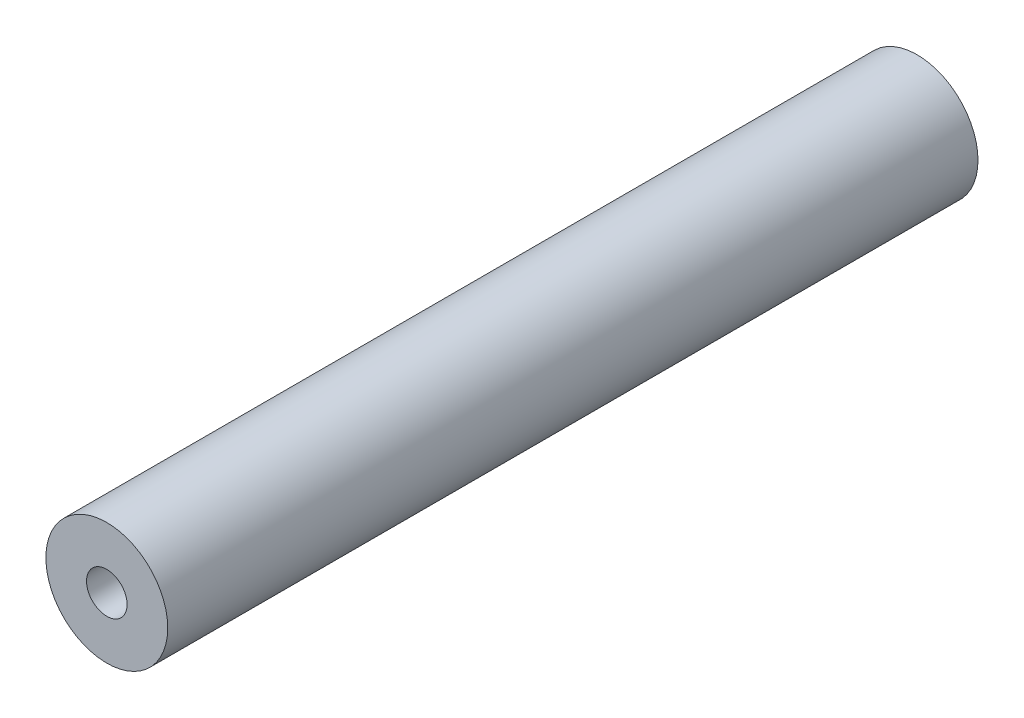
ISO-10303-21;
HEADER;
FILE_DESCRIPTION(('STEP AP214'),'2;1');
FILE_NAME('part.step','',(''),(''),'','','');
FILE_SCHEMA(('AUTOMOTIVE_DESIGN { 1 0 10303 214 1 1 1 1 }'));
ENDSEC;
DATA;
#1=APPLICATION_CONTEXT('core data for automotive mechanical design processes');
#2=APPLICATION_PROTOCOL_DEFINITION('international standard','automotive_design',2000,#1);
#3=PRODUCT_CONTEXT('',#1,'mechanical');
#4=PRODUCT('Part','Part','',(#3));
#5=PRODUCT_RELATED_PRODUCT_CATEGORY('part','',(#4));
#6=PRODUCT_DEFINITION_FORMATION('','',#4);
#7=PRODUCT_DEFINITION_CONTEXT('part definition',#1,'design');
#8=PRODUCT_DEFINITION('design','',#6,#7);
#9=PRODUCT_DEFINITION_SHAPE('','',#8);
#10=(LENGTH_UNIT() NAMED_UNIT(*) SI_UNIT(.MILLI.,.METRE.));
#11=(NAMED_UNIT(*) PLANE_ANGLE_UNIT() SI_UNIT($,.RADIAN.));
#12=(NAMED_UNIT(*) SI_UNIT($,.STERADIAN.) SOLID_ANGLE_UNIT());
#13=UNCERTAINTY_MEASURE_WITH_UNIT(LENGTH_MEASURE(1.E-05),#10,'distance_accuracy_value','');
#14=(GEOMETRIC_REPRESENTATION_CONTEXT(3) GLOBAL_UNCERTAINTY_ASSIGNED_CONTEXT((#13)) GLOBAL_UNIT_ASSIGNED_CONTEXT((#10,
#11,#12)) REPRESENTATION_CONTEXT('',''));
#15=CARTESIAN_POINT('',(0.,0.,0.));
#16=DIRECTION('',(0.,0.,1.));
#17=DIRECTION('',(1.,0.,0.));
#18=AXIS2_PLACEMENT_3D('',#15,#16,#17);
#19=CARTESIAN_POINT('',(0.,0.,-50.673));
#20=DIRECTION('',(0.,0.,1.));
#21=DIRECTION('',(1.,0.,0.));
#22=AXIS2_PLACEMENT_3D('',#19,#20,#21);
#23=CYLINDRICAL_SURFACE('',#22,3.81);
#24=CARTESIAN_POINT('',(0.,0.,-50.673));
#25=DIRECTION('',(0.,0.,1.));
#26=DIRECTION('',(1.,0.,0.));
#27=AXIS2_PLACEMENT_3D('',#24,#25,#26);
#28=CIRCLE('',#27,3.81);
#29=CARTESIAN_POINT('',(3.81,0.,-50.673));
#30=VERTEX_POINT('',#29);
#31=EDGE_CURVE('E10',#30,#30,#28,.T.);
#32=ORIENTED_EDGE('',*,*,#31,.T.);
#33=EDGE_LOOP('',(#32));
#34=FACE_BOUND('',#33,.T.);
#35=CARTESIAN_POINT('',(0.,0.,0.));
#36=DIRECTION('',(0.,0.,1.));
#37=DIRECTION('',(1.,0.,0.));
#38=AXIS2_PLACEMENT_3D('',#35,#36,#37);
#39=CIRCLE('',#38,3.81);
#40=CARTESIAN_POINT('',(3.81,0.,0.));
#41=VERTEX_POINT('',#40);
#42=EDGE_CURVE('E37',#41,#41,#39,.T.);
#43=ORIENTED_EDGE('',*,*,#42,.F.);
#44=EDGE_LOOP('',(#43));
#45=FACE_BOUND('',#44,.T.);
#46=ADVANCED_FACE('F34',(#34,#45),#23,.T.);
#47=CARTESIAN_POINT('',(0.,0.,-50.673));
#48=DIRECTION('',(0.,0.,1.));
#49=DIRECTION('',(1.,0.,0.));
#50=AXIS2_PLACEMENT_3D('',#47,#48,#49);
#51=PLANE('',#50);
#52=CARTESIAN_POINT('',(0.,0.,-50.673));
#53=DIRECTION('',(0.,0.,1.));
#54=DIRECTION('',(1.,0.,0.));
#55=AXIS2_PLACEMENT_3D('',#52,#53,#54);
#56=CIRCLE('',#55,1.27);
#57=CARTESIAN_POINT('',(1.27,0.,-50.673));
#58=VERTEX_POINT('',#57);
#59=EDGE_CURVE('E44',#58,#58,#56,.T.);
#60=ORIENTED_EDGE('',*,*,#59,.T.);
#61=EDGE_LOOP('',(#60));
#62=FACE_BOUND('',#61,.T.);
#63=ORIENTED_EDGE('',*,*,#31,.F.);
#64=EDGE_LOOP('',(#63));
#65=FACE_BOUND('',#64,.T.);
#66=ADVANCED_FACE('F52',(#62,#65),#51,.F.);
#67=CARTESIAN_POINT('',(0.,0.,0.));
#68=DIRECTION('',(0.,0.,1.));
#69=DIRECTION('',(1.,0.,0.));
#70=AXIS2_PLACEMENT_3D('',#67,#68,#69);
#71=PLANE('',#70);
#72=CARTESIAN_POINT('',(0.,0.,0.));
#73=DIRECTION('',(0.,0.,1.));
#74=DIRECTION('',(1.,0.,0.));
#75=AXIS2_PLACEMENT_3D('',#72,#73,#74);
#76=CIRCLE('',#75,1.27);
#77=CARTESIAN_POINT('',(1.27,0.,0.));
#78=VERTEX_POINT('',#77);
#79=EDGE_CURVE('E46',#78,#78,#76,.T.);
#80=ORIENTED_EDGE('',*,*,#79,.F.);
#81=EDGE_LOOP('',(#80));
#82=FACE_BOUND('',#81,.T.);
#83=ORIENTED_EDGE('',*,*,#42,.T.);
#84=EDGE_LOOP('',(#83));
#85=FACE_BOUND('',#84,.T.);
#86=ADVANCED_FACE('F58',(#82,#85),#71,.T.);
#87=CARTESIAN_POINT('',(0.,0.,-50.673));
#88=DIRECTION('',(0.,0.,1.));
#89=DIRECTION('',(1.,0.,0.));
#90=AXIS2_PLACEMENT_3D('',#87,#88,#89);
#91=CYLINDRICAL_SURFACE('',#90,1.27);
#92=ORIENTED_EDGE('',*,*,#59,.F.);
#93=EDGE_LOOP('',(#92));
#94=FACE_BOUND('',#93,.T.);
#95=ORIENTED_EDGE('',*,*,#79,.T.);
#96=EDGE_LOOP('',(#95));
#97=FACE_BOUND('',#96,.T.);
#98=ADVANCED_FACE('F55',(#94,#97),#91,.F.);
#99=CLOSED_SHELL('',(#46,#66,#86,#98));
#100=MANIFOLD_SOLID_BREP('B2',#99);
#101=ADVANCED_BREP_SHAPE_REPRESENTATION('',(#18,#100),#14);
#102=SHAPE_DEFINITION_REPRESENTATION(#9,#101);
ENDSEC;
END-ISO-10303-21;
